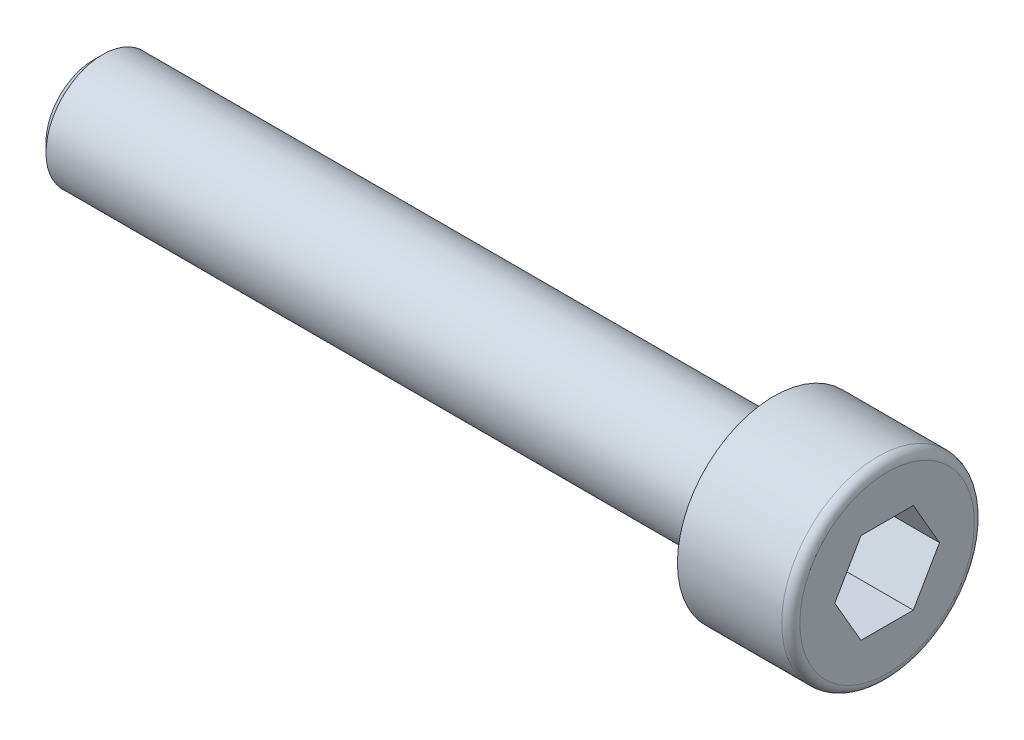
ISO-10303-21;
HEADER;
FILE_DESCRIPTION(('STEP AP214'),'2;1');
FILE_NAME('part.step','',(''),(''),'','','');
FILE_SCHEMA(('AUTOMOTIVE_DESIGN { 1 0 10303 214 1 1 1 1 }'));
ENDSEC;
DATA;
#1=APPLICATION_CONTEXT('core data for automotive mechanical design processes');
#2=APPLICATION_PROTOCOL_DEFINITION('international standard','automotive_design',2000,#1);
#3=PRODUCT_CONTEXT('',#1,'mechanical');
#4=PRODUCT('Part','Part','',(#3));
#5=PRODUCT_RELATED_PRODUCT_CATEGORY('part','',(#4));
#6=PRODUCT_DEFINITION_FORMATION('','',#4);
#7=PRODUCT_DEFINITION_CONTEXT('part definition',#1,'design');
#8=PRODUCT_DEFINITION('design','',#6,#7);
#9=PRODUCT_DEFINITION_SHAPE('','',#8);
#10=(LENGTH_UNIT() NAMED_UNIT(*) SI_UNIT(.MILLI.,.METRE.));
#11=(NAMED_UNIT(*) PLANE_ANGLE_UNIT() SI_UNIT($,.RADIAN.));
#12=(NAMED_UNIT(*) SI_UNIT($,.STERADIAN.) SOLID_ANGLE_UNIT());
#13=UNCERTAINTY_MEASURE_WITH_UNIT(LENGTH_MEASURE(1.E-05),#10,'distance_accuracy_value','');
#14=(GEOMETRIC_REPRESENTATION_CONTEXT(3) GLOBAL_UNCERTAINTY_ASSIGNED_CONTEXT((#13)) GLOBAL_UNIT_ASSIGNED_CONTEXT((#10,
#11,#12)) REPRESENTATION_CONTEXT('',''));
#15=CARTESIAN_POINT('',(0.,0.,0.));
#16=DIRECTION('',(0.,0.,1.));
#17=DIRECTION('',(1.,0.,0.));
#18=AXIS2_PLACEMENT_3D('',#15,#16,#17);
#19=CARTESIAN_POINT('',(0.,0.,0.));
#20=DIRECTION('',(-1.,0.,0.));
#21=DIRECTION('',(0.,0.,1.));
#22=AXIS2_PLACEMENT_3D('',#19,#20,#21);
#23=PLANE('',#22);
#24=DIRECTION('',(0.,0.866025403784438,0.5));
#25=VECTOR('',#24,1.);
#26=CARTESIAN_POINT('',(0.,0.,-2.3094010767585));
#27=LINE('',#26,#25);
#28=CARTESIAN_POINT('',(0.,0.,-2.3094010767585));
#29=VERTEX_POINT('',#28);
#30=CARTESIAN_POINT('',(0.,2.,-1.15470053837925));
#31=VERTEX_POINT('',#30);
#32=EDGE_CURVE('E109',#29,#31,#27,.T.);
#33=ORIENTED_EDGE('',*,*,#32,.F.);
#34=DIRECTION('',(0.,0.866025403784438,-0.5));
#35=VECTOR('',#34,1.);
#36=CARTESIAN_POINT('',(0.,-2.,-1.15470053837925));
#37=LINE('',#36,#35);
#38=CARTESIAN_POINT('',(0.,-2.,-1.15470053837925));
#39=VERTEX_POINT('',#38);
#40=EDGE_CURVE('E51',#39,#29,#37,.T.);
#41=ORIENTED_EDGE('',*,*,#40,.F.);
#42=DIRECTION('',(0.,0.,-1.));
#43=VECTOR('',#42,1.);
#44=CARTESIAN_POINT('',(0.,-2.,1.15470053837925));
#45=LINE('',#44,#43);
#46=CARTESIAN_POINT('',(0.,-2.,1.15470053837925));
#47=VERTEX_POINT('',#46);
#48=EDGE_CURVE('E124',#47,#39,#45,.T.);
#49=ORIENTED_EDGE('',*,*,#48,.F.);
#50=DIRECTION('',(0.,-0.866025403784438,-0.5));
#51=VECTOR('',#50,1.);
#52=CARTESIAN_POINT('',(0.,0.,2.3094010767585));
#53=LINE('',#52,#51);
#54=CARTESIAN_POINT('',(0.,0.,2.3094010767585));
#55=VERTEX_POINT('',#54);
#56=EDGE_CURVE('E118',#55,#47,#53,.T.);
#57=ORIENTED_EDGE('',*,*,#56,.F.);
#58=DIRECTION('',(0.,-0.866025403784439,0.5));
#59=VECTOR('',#58,1.);
#60=CARTESIAN_POINT('',(0.,2.,1.15470053837925));
#61=LINE('',#60,#59);
#62=CARTESIAN_POINT('',(0.,2.,1.15470053837925));
#63=VERTEX_POINT('',#62);
#64=EDGE_CURVE('E116',#63,#55,#61,.T.);
#65=ORIENTED_EDGE('',*,*,#64,.F.);
#66=DIRECTION('',(0.,0.,1.));
#67=VECTOR('',#66,1.);
#68=CARTESIAN_POINT('',(0.,2.,-1.15470053837925));
#69=LINE('',#68,#67);
#70=EDGE_CURVE('E102',#31,#63,#69,.T.);
#71=ORIENTED_EDGE('',*,*,#70,.F.);
#72=EDGE_LOOP('',(#33,#41,#49,#57,#65,#71));
#73=FACE_BOUND('',#72,.T.);
#74=CARTESIAN_POINT('',(0.,0.,0.));
#75=DIRECTION('',(-1.,0.,0.));
#76=DIRECTION('',(0.,0.,1.));
#77=AXIS2_PLACEMENT_3D('',#74,#75,#76);
#78=CIRCLE('',#77,3.85);
#79=CARTESIAN_POINT('',(0.,0.,3.85));
#80=VERTEX_POINT('',#79);
#81=EDGE_CURVE('E12',#80,#80,#78,.F.);
#82=ORIENTED_EDGE('',*,*,#81,.T.);
#83=EDGE_LOOP('',(#82));
#84=FACE_BOUND('',#83,.T.);
#85=ADVANCED_FACE('F36',(#73,#84),#23,.F.);
#86=CARTESIAN_POINT('',(-123.158940217391,0.,0.));
#87=DIRECTION('',(-1.,0.,0.));
#88=DIRECTION('',(0.,0.,1.));
#89=AXIS2_PLACEMENT_3D('',#86,#87,#88);
#90=CYLINDRICAL_SURFACE('',#89,4.25);
#91=CARTESIAN_POINT('',(-0.399999999999998,0.,0.));
#92=DIRECTION('',(-1.,0.,0.));
#93=DIRECTION('',(0.,0.,1.));
#94=AXIS2_PLACEMENT_3D('',#91,#92,#93);
#95=CIRCLE('',#94,4.25);
#96=CARTESIAN_POINT('',(-0.399999999999998,0.,4.25));
#97=VERTEX_POINT('',#96);
#98=EDGE_CURVE('E44',#97,#97,#95,.T.);
#99=ORIENTED_EDGE('',*,*,#98,.T.);
#100=EDGE_LOOP('',(#99));
#101=FACE_BOUND('',#100,.T.);
#102=CARTESIAN_POINT('',(-5.,0.,0.));
#103=DIRECTION('',(-1.,0.,0.));
#104=DIRECTION('',(0.,0.,1.));
#105=AXIS2_PLACEMENT_3D('',#102,#103,#104);
#106=CIRCLE('',#105,4.25);
#107=CARTESIAN_POINT('',(-5.,0.,4.25));
#108=VERTEX_POINT('',#107);
#109=EDGE_CURVE('E139',#108,#108,#106,.T.);
#110=ORIENTED_EDGE('',*,*,#109,.F.);
#111=EDGE_LOOP('',(#110));
#112=FACE_BOUND('',#111,.T.);
#113=ADVANCED_FACE('F150',(#101,#112),#90,.T.);
#114=CARTESIAN_POINT('',(-5.,4.25,0.));
#115=DIRECTION('',(1.,0.,0.));
#116=DIRECTION('',(0.,0.,-1.));
#117=AXIS2_PLACEMENT_3D('',#114,#115,#116);
#118=PLANE('',#117);
#119=CARTESIAN_POINT('',(-5.,0.,0.));
#120=DIRECTION('',(-1.,0.,0.));
#121=DIRECTION('',(0.,0.,1.));
#122=AXIS2_PLACEMENT_3D('',#119,#120,#121);
#123=CIRCLE('',#122,2.5);
#124=CARTESIAN_POINT('',(-5.,0.,2.5));
#125=VERTEX_POINT('',#124);
#126=EDGE_CURVE('E136',#125,#125,#123,.T.);
#127=ORIENTED_EDGE('',*,*,#126,.F.);
#128=EDGE_LOOP('',(#127));
#129=FACE_BOUND('',#128,.T.);
#130=ORIENTED_EDGE('',*,*,#109,.T.);
#131=EDGE_LOOP('',(#130));
#132=FACE_BOUND('',#131,.T.);
#133=ADVANCED_FACE('F171',(#129,#132),#118,.F.);
#134=CARTESIAN_POINT('',(-123.158940217391,0.,0.));
#135=DIRECTION('',(-1.,0.,0.));
#136=DIRECTION('',(0.,0.,1.));
#137=AXIS2_PLACEMENT_3D('',#134,#135,#136);
#138=CYLINDRICAL_SURFACE('',#137,2.5);
#139=CARTESIAN_POINT('',(-34.6,0.,0.));
#140=DIRECTION('',(1.,0.,0.));
#141=DIRECTION('',(0.,0.,-1.));
#142=AXIS2_PLACEMENT_3D('',#139,#140,#141);
#143=CIRCLE('',#142,2.5);
#144=CARTESIAN_POINT('',(-34.6,0.,-2.5));
#145=VERTEX_POINT('',#144);
#146=EDGE_CURVE('E145',#145,#145,#143,.T.);
#147=ORIENTED_EDGE('',*,*,#146,.T.);
#148=EDGE_LOOP('',(#147));
#149=FACE_BOUND('',#148,.T.);
#150=ORIENTED_EDGE('',*,*,#126,.T.);
#151=EDGE_LOOP('',(#150));
#152=FACE_BOUND('',#151,.T.);
#153=ADVANCED_FACE('F176',(#149,#152),#138,.T.);
#154=CARTESIAN_POINT('',(-35.,2.5,0.));
#155=DIRECTION('',(1.,0.,0.));
#156=DIRECTION('',(0.,0.,-1.));
#157=AXIS2_PLACEMENT_3D('',#154,#155,#156);
#158=PLANE('',#157);
#159=CARTESIAN_POINT('',(-35.,0.,0.));
#160=DIRECTION('',(1.,0.,0.));
#161=DIRECTION('',(0.,0.,-1.));
#162=AXIS2_PLACEMENT_3D('',#159,#160,#161);
#163=CIRCLE('',#162,2.1);
#164=CARTESIAN_POINT('',(-35.,0.,-2.1));
#165=VERTEX_POINT('',#164);
#166=EDGE_CURVE('E142',#165,#165,#163,.F.);
#167=ORIENTED_EDGE('',*,*,#166,.T.);
#168=EDGE_LOOP('',(#167));
#169=FACE_BOUND('',#168,.T.);
#170=ADVANCED_FACE('F163',(#169),#158,.F.);
#171=CARTESIAN_POINT('',(-35.,0.,0.));
#172=DIRECTION('',(1.,0.,0.));
#173=DIRECTION('',(0.,0.,-1.));
#174=AXIS2_PLACEMENT_3D('',#171,#172,#173);
#175=CONICAL_SURFACE('',#174,2.1,0.785398163397434);
#176=ORIENTED_EDGE('',*,*,#146,.F.);
#177=EDGE_LOOP('',(#176));
#178=FACE_BOUND('',#177,.T.);
#179=ORIENTED_EDGE('',*,*,#166,.F.);
#180=EDGE_LOOP('',(#179));
#181=FACE_BOUND('',#180,.T.);
#182=ADVANCED_FACE('F155',(#178,#181),#175,.T.);
#183=CARTESIAN_POINT('',(-0.399999999999998,0.,0.));
#184=DIRECTION('',(-1.,0.,0.));
#185=DIRECTION('',(0.,0.,1.));
#186=AXIS2_PLACEMENT_3D('',#183,#184,#185);
#187=TOROIDAL_SURFACE('',#186,3.85,0.4);
#188=ORIENTED_EDGE('',*,*,#81,.F.);
#189=EDGE_LOOP('',(#188));
#190=FACE_BOUND('',#189,.T.);
#191=ORIENTED_EDGE('',*,*,#98,.F.);
#192=EDGE_LOOP('',(#191));
#193=FACE_BOUND('',#192,.T.);
#194=ADVANCED_FACE('F38',(#190,#193),#187,.T.);
#195=CARTESIAN_POINT('',(-11.1101009266078,-2.,-1.15470053837925));
#196=DIRECTION('',(0.,-0.5,-0.866025403784438));
#197=DIRECTION('',(0.,0.866025403784439,-0.5));
#198=AXIS2_PLACEMENT_3D('',#195,#196,#197);
#199=PLANE('',#198);
#200=DIRECTION('',(0.,-0.866025403784439,0.5));
#201=VECTOR('',#200,1.);
#202=CARTESIAN_POINT('',(-4.,-2.,-1.15470053837925));
#203=LINE('',#202,#201);
#204=CARTESIAN_POINT('',(-4.,0.,-2.3094010767585));
#205=VERTEX_POINT('',#204);
#206=CARTESIAN_POINT('',(-4.,-2.,-1.15470053837925));
#207=VERTEX_POINT('',#206);
#208=EDGE_CURVE('E70',#205,#207,#203,.T.);
#209=ORIENTED_EDGE('',*,*,#208,.T.);
#210=DIRECTION('',(1.,0.,0.));
#211=VECTOR('',#210,1.);
#212=CARTESIAN_POINT('',(-11.1101009266078,-2.,-1.15470053837925));
#213=LINE('',#212,#211);
#214=EDGE_CURVE('E127',#207,#39,#213,.T.);
#215=ORIENTED_EDGE('',*,*,#214,.T.);
#216=ORIENTED_EDGE('',*,*,#40,.T.);
#217=DIRECTION('',(1.,0.,0.));
#218=VECTOR('',#217,1.);
#219=CARTESIAN_POINT('',(-11.1101009266078,0.,-2.3094010767585));
#220=LINE('',#219,#218);
#221=EDGE_CURVE('E106',#205,#29,#220,.T.);
#222=ORIENTED_EDGE('',*,*,#221,.F.);
#223=EDGE_LOOP('',(#209,#215,#216,#222));
#224=FACE_BOUND('',#223,.T.);
#225=ADVANCED_FACE('F154',(#224),#199,.F.);
#226=CARTESIAN_POINT('',(-11.1101009266078,-2.,1.15470053837925));
#227=DIRECTION('',(0.,-1.,0.));
#228=DIRECTION('',(0.,0.,-1.));
#229=AXIS2_PLACEMENT_3D('',#226,#227,#228);
#230=PLANE('',#229);
#231=DIRECTION('',(0.,0.,1.));
#232=VECTOR('',#231,1.);
#233=CARTESIAN_POINT('',(-4.,-2.,1.15470053837925));
#234=LINE('',#233,#232);
#235=CARTESIAN_POINT('',(-4.,-2.,1.15470053837925));
#236=VERTEX_POINT('',#235);
#237=EDGE_CURVE('E204',#207,#236,#234,.T.);
#238=ORIENTED_EDGE('',*,*,#237,.T.);
#239=DIRECTION('',(1.,0.,0.));
#240=VECTOR('',#239,1.);
#241=CARTESIAN_POINT('',(-11.1101009266078,-2.,1.15470053837925));
#242=LINE('',#241,#240);
#243=EDGE_CURVE('E129',#236,#47,#242,.T.);
#244=ORIENTED_EDGE('',*,*,#243,.T.);
#245=ORIENTED_EDGE('',*,*,#48,.T.);
#246=ORIENTED_EDGE('',*,*,#214,.F.);
#247=EDGE_LOOP('',(#238,#244,#245,#246));
#248=FACE_BOUND('',#247,.T.);
#249=ADVANCED_FACE('F161',(#248),#230,.F.);
#250=CARTESIAN_POINT('',(-11.1101009266078,0.,2.3094010767585));
#251=DIRECTION('',(0.,-0.5,0.866025403784438));
#252=DIRECTION('',(0.,-0.866025403784439,-0.5));
#253=AXIS2_PLACEMENT_3D('',#250,#251,#252);
#254=PLANE('',#253);
#255=DIRECTION('',(0.,0.866025403784439,0.5));
#256=VECTOR('',#255,1.);
#257=CARTESIAN_POINT('',(-4.,0.,2.3094010767585));
#258=LINE('',#257,#256);
#259=CARTESIAN_POINT('',(-4.,0.,2.3094010767585));
#260=VERTEX_POINT('',#259);
#261=EDGE_CURVE('E207',#236,#260,#258,.T.);
#262=ORIENTED_EDGE('',*,*,#261,.T.);
#263=DIRECTION('',(1.,0.,0.));
#264=VECTOR('',#263,1.);
#265=CARTESIAN_POINT('',(-11.1101009266078,0.,2.3094010767585));
#266=LINE('',#265,#264);
#267=EDGE_CURVE('E131',#260,#55,#266,.T.);
#268=ORIENTED_EDGE('',*,*,#267,.T.);
#269=ORIENTED_EDGE('',*,*,#56,.T.);
#270=ORIENTED_EDGE('',*,*,#243,.F.);
#271=EDGE_LOOP('',(#262,#268,#269,#270));
#272=FACE_BOUND('',#271,.T.);
#273=ADVANCED_FACE('F192',(#272),#254,.F.);
#274=CARTESIAN_POINT('',(-11.1101009266078,2.,1.15470053837925));
#275=DIRECTION('',(0.,0.5,0.866025403784438));
#276=DIRECTION('',(0.,-0.866025403784439,0.5));
#277=AXIS2_PLACEMENT_3D('',#274,#275,#276);
#278=PLANE('',#277);
#279=DIRECTION('',(0.,0.866025403784439,-0.5));
#280=VECTOR('',#279,1.);
#281=CARTESIAN_POINT('',(-4.,2.,1.15470053837925));
#282=LINE('',#281,#280);
#283=CARTESIAN_POINT('',(-4.,2.,1.15470053837925));
#284=VERTEX_POINT('',#283);
#285=EDGE_CURVE('E60',#260,#284,#282,.T.);
#286=ORIENTED_EDGE('',*,*,#285,.T.);
#287=DIRECTION('',(1.,0.,0.));
#288=VECTOR('',#287,1.);
#289=CARTESIAN_POINT('',(-11.1101009266078,2.,1.15470053837925));
#290=LINE('',#289,#288);
#291=EDGE_CURVE('E105',#284,#63,#290,.T.);
#292=ORIENTED_EDGE('',*,*,#291,.T.);
#293=ORIENTED_EDGE('',*,*,#64,.T.);
#294=ORIENTED_EDGE('',*,*,#267,.F.);
#295=EDGE_LOOP('',(#286,#292,#293,#294));
#296=FACE_BOUND('',#295,.T.);
#297=ADVANCED_FACE('F189',(#296),#278,.F.);
#298=CARTESIAN_POINT('',(-11.1101009266078,2.,-1.15470053837925));
#299=DIRECTION('',(0.,1.,0.));
#300=DIRECTION('',(0.,0.,1.));
#301=AXIS2_PLACEMENT_3D('',#298,#299,#300);
#302=PLANE('',#301);
#303=DIRECTION('',(0.,0.,-1.));
#304=VECTOR('',#303,1.);
#305=CARTESIAN_POINT('',(-4.,2.,-1.15470053837925));
#306=LINE('',#305,#304);
#307=CARTESIAN_POINT('',(-4.,2.,-1.15470053837925));
#308=VERTEX_POINT('',#307);
#309=EDGE_CURVE('E104',#284,#308,#306,.T.);
#310=ORIENTED_EDGE('',*,*,#309,.T.);
#311=DIRECTION('',(1.,0.,0.));
#312=VECTOR('',#311,1.);
#313=CARTESIAN_POINT('',(-11.1101009266078,2.,-1.15470053837925));
#314=LINE('',#313,#312);
#315=EDGE_CURVE('E97',#308,#31,#314,.T.);
#316=ORIENTED_EDGE('',*,*,#315,.T.);
#317=ORIENTED_EDGE('',*,*,#70,.T.);
#318=ORIENTED_EDGE('',*,*,#291,.F.);
#319=EDGE_LOOP('',(#310,#316,#317,#318));
#320=FACE_BOUND('',#319,.T.);
#321=ADVANCED_FACE('F99',(#320),#302,.F.);
#322=CARTESIAN_POINT('',(-11.1101009266078,0.,-2.3094010767585));
#323=DIRECTION('',(0.,0.5,-0.866025403784438));
#324=DIRECTION('',(0.,0.866025403784438,0.5));
#325=AXIS2_PLACEMENT_3D('',#322,#323,#324);
#326=PLANE('',#325);
#327=DIRECTION('',(0.,-0.866025403784438,-0.5));
#328=VECTOR('',#327,1.);
#329=CARTESIAN_POINT('',(-4.,0.,-2.3094010767585));
#330=LINE('',#329,#328);
#331=EDGE_CURVE('E79',#308,#205,#330,.T.);
#332=ORIENTED_EDGE('',*,*,#331,.T.);
#333=ORIENTED_EDGE('',*,*,#221,.T.);
#334=ORIENTED_EDGE('',*,*,#32,.T.);
#335=ORIENTED_EDGE('',*,*,#315,.F.);
#336=EDGE_LOOP('',(#332,#333,#334,#335));
#337=FACE_BOUND('',#336,.T.);
#338=ADVANCED_FACE('F110',(#337),#326,.F.);
#339=CARTESIAN_POINT('',(-4.,4.25,0.));
#340=DIRECTION('',(1.,0.,0.));
#341=DIRECTION('',(0.,0.,-1.));
#342=AXIS2_PLACEMENT_3D('',#339,#340,#341);
#343=PLANE('',#342);
#344=ORIENTED_EDGE('',*,*,#208,.F.);
#345=ORIENTED_EDGE('',*,*,#331,.F.);
#346=ORIENTED_EDGE('',*,*,#309,.F.);
#347=ORIENTED_EDGE('',*,*,#285,.F.);
#348=ORIENTED_EDGE('',*,*,#261,.F.);
#349=ORIENTED_EDGE('',*,*,#237,.F.);
#350=EDGE_LOOP('',(#344,#345,#346,#347,#348,#349));
#351=FACE_BOUND('',#350,.T.);
#352=ADVANCED_FACE('F186',(#351),#343,.T.);
#353=CLOSED_SHELL('',(#85,#113,#133,#153,#170,#182,#194,#225,#249,#273,#297,#321,#338,#352));
#354=MANIFOLD_SOLID_BREP('B2',#353);
#355=ADVANCED_BREP_SHAPE_REPRESENTATION('',(#18,#354),#14);
#356=SHAPE_DEFINITION_REPRESENTATION(#9,#355);
ENDSEC;
END-ISO-10303-21;
